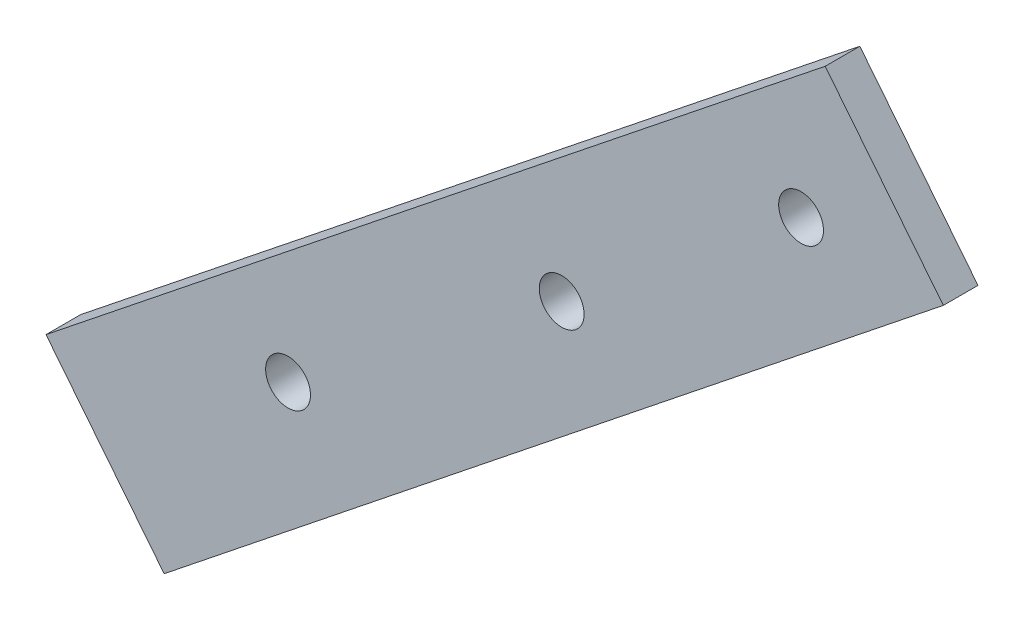
ISO-10303-21;
HEADER;
FILE_DESCRIPTION(('STEP AP214'),'2;1');
FILE_NAME('part.step','',(''),(''),'','','');
FILE_SCHEMA(('AUTOMOTIVE_DESIGN { 1 0 10303 214 1 1 1 1 }'));
ENDSEC;
DATA;
#1=APPLICATION_CONTEXT('core data for automotive mechanical design processes');
#2=APPLICATION_PROTOCOL_DEFINITION('international standard','automotive_design',2000,#1);
#3=PRODUCT_CONTEXT('',#1,'mechanical');
#4=PRODUCT('Part','Part','',(#3));
#5=PRODUCT_RELATED_PRODUCT_CATEGORY('part','',(#4));
#6=PRODUCT_DEFINITION_FORMATION('','',#4);
#7=PRODUCT_DEFINITION_CONTEXT('part definition',#1,'design');
#8=PRODUCT_DEFINITION('design','',#6,#7);
#9=PRODUCT_DEFINITION_SHAPE('','',#8);
#10=(LENGTH_UNIT() NAMED_UNIT(*) SI_UNIT(.MILLI.,.METRE.));
#11=(NAMED_UNIT(*) PLANE_ANGLE_UNIT() SI_UNIT($,.RADIAN.));
#12=(NAMED_UNIT(*) SI_UNIT($,.STERADIAN.) SOLID_ANGLE_UNIT());
#13=UNCERTAINTY_MEASURE_WITH_UNIT(LENGTH_MEASURE(1.E-05),#10,'distance_accuracy_value','');
#14=(GEOMETRIC_REPRESENTATION_CONTEXT(3) GLOBAL_UNCERTAINTY_ASSIGNED_CONTEXT((#13)) GLOBAL_UNIT_ASSIGNED_CONTEXT((#10,
#11,#12)) REPRESENTATION_CONTEXT('',''));
#15=CARTESIAN_POINT('',(0.,0.,0.));
#16=DIRECTION('',(0.,0.,1.));
#17=DIRECTION('',(1.,0.,0.));
#18=AXIS2_PLACEMENT_3D('',#15,#16,#17);
#19=CARTESIAN_POINT('',(0.,0.,10.));
#20=DIRECTION('',(0.,0.,-1.));
#21=DIRECTION('',(-1.,0.,0.));
#22=AXIS2_PLACEMENT_3D('',#19,#20,#21);
#23=PLANE('',#22);
#24=DIRECTION('',(0.781539754006802,0.623855442315756,0.));
#25=VECTOR('',#24,1.);
#26=CARTESIAN_POINT('',(224.825421521922,179.464399690875,10.));
#27=LINE('',#26,#25);
#28=CARTESIAN_POINT('',(0.,0.,10.));
#29=VERTEX_POINT('',#28);
#30=CARTESIAN_POINT('',(224.825421521922,179.464399690875,10.));
#31=VERTEX_POINT('',#30);
#32=EDGE_CURVE('E87',#29,#31,#27,.T.);
#33=ORIENTED_EDGE('',*,*,#32,.T.);
#34=DIRECTION('',(-0.623855442315756,0.781539754006802,0.));
#35=VECTOR('',#34,1.);
#36=CARTESIAN_POINT('',(190.731046947323,222.176392422936,10.));
#37=LINE('',#36,#35);
#38=CARTESIAN_POINT('',(190.731046947323,222.176392422936,10.));
#39=VERTEX_POINT('',#38);
#40=EDGE_CURVE('E82',#31,#39,#37,.T.);
#41=ORIENTED_EDGE('',*,*,#40,.T.);
#42=DIRECTION('',(-0.781539754006802,-0.623855442315756,0.));
#43=VECTOR('',#42,1.);
#44=CARTESIAN_POINT('',(-34.0943745745987,42.7119927320616,10.));
#45=LINE('',#44,#43);
#46=CARTESIAN_POINT('',(-34.0943745745987,42.7119927320616,10.));
#47=VERTEX_POINT('',#46);
#48=EDGE_CURVE('E85',#39,#47,#45,.T.);
#49=ORIENTED_EDGE('',*,*,#48,.T.);
#50=DIRECTION('',(0.623855442315756,-0.781539754006802,0.));
#51=VECTOR('',#50,1.);
#52=CARTESIAN_POINT('',(0.,0.,10.));
#53=LINE('',#52,#51);
#54=EDGE_CURVE('E52',#47,#29,#53,.T.);
#55=ORIENTED_EDGE('',*,*,#54,.T.);
#56=EDGE_LOOP('',(#33,#41,#49,#55));
#57=FACE_BOUND('',#56,.T.);
#58=CARTESIAN_POINT('',(35.7431737784992,65.7604217365133,10.));
#59=DIRECTION('',(0.,0.,1.));
#60=DIRECTION('',(1.,0.,0.));
#61=AXIS2_PLACEMENT_3D('',#58,#59,#60);
#62=CIRCLE('',#61,6.4699503332406);
#63=CARTESIAN_POINT('',(42.2131241117398,65.7604217365133,10.));
#64=VERTEX_POINT('',#63);
#65=EDGE_CURVE('E102',#64,#64,#62,.T.);
#66=ORIENTED_EDGE('',*,*,#65,.F.);
#67=EDGE_LOOP('',(#66));
#68=FACE_BOUND('',#67,.T.);
#69=CARTESIAN_POINT('',(114.698226452134,125.411384111032,10.));
#70=DIRECTION('',(0.,0.,1.));
#71=DIRECTION('',(1.,0.,0.));
#72=AXIS2_PLACEMENT_3D('',#69,#70,#71);
#73=CIRCLE('',#72,6.4699503332406);
#74=CARTESIAN_POINT('',(121.168176785375,125.411384111032,10.));
#75=VERTEX_POINT('',#74);
#76=EDGE_CURVE('E117',#75,#75,#73,.T.);
#77=ORIENTED_EDGE('',*,*,#76,.F.);
#78=EDGE_LOOP('',(#77));
#79=FACE_BOUND('',#78,.T.);
#80=CARTESIAN_POINT('',(183.769608582089,180.906879578004,10.));
#81=DIRECTION('',(0.,0.,1.));
#82=DIRECTION('',(1.,0.,0.));
#83=AXIS2_PLACEMENT_3D('',#80,#81,#82);
#84=CIRCLE('',#83,6.4699503332406);
#85=CARTESIAN_POINT('',(190.23955891533,180.906879578004,10.));
#86=VERTEX_POINT('',#85);
#87=EDGE_CURVE('E123',#86,#86,#84,.T.);
#88=ORIENTED_EDGE('',*,*,#87,.F.);
#89=EDGE_LOOP('',(#88));
#90=FACE_BOUND('',#89,.T.);
#91=ADVANCED_FACE('F35',(#57,#68,#79,#90),#23,.F.);
#92=CARTESIAN_POINT('',(0.,0.,0.));
#93=DIRECTION('',(0.,0.,-1.));
#94=DIRECTION('',(-1.,0.,0.));
#95=AXIS2_PLACEMENT_3D('',#92,#93,#94);
#96=PLANE('',#95);
#97=CARTESIAN_POINT('',(114.698226452134,125.411384111032,0.));
#98=DIRECTION('',(0.,0.,1.));
#99=DIRECTION('',(1.,0.,0.));
#100=AXIS2_PLACEMENT_3D('',#97,#98,#99);
#101=CIRCLE('',#100,6.4699503332406);
#102=CARTESIAN_POINT('',(121.168176785375,125.411384111032,0.));
#103=VERTEX_POINT('',#102);
#104=EDGE_CURVE('E120',#103,#103,#101,.T.);
#105=ORIENTED_EDGE('',*,*,#104,.T.);
#106=EDGE_LOOP('',(#105));
#107=FACE_BOUND('',#106,.T.);
#108=DIRECTION('',(0.781539754006802,0.623855442315756,0.));
#109=VECTOR('',#108,1.);
#110=CARTESIAN_POINT('',(224.825421521922,179.464399690875,0.));
#111=LINE('',#110,#109);
#112=CARTESIAN_POINT('',(0.,0.,0.));
#113=VERTEX_POINT('',#112);
#114=CARTESIAN_POINT('',(224.825421521922,179.464399690875,0.));
#115=VERTEX_POINT('',#114);
#116=EDGE_CURVE('E99',#113,#115,#111,.T.);
#117=ORIENTED_EDGE('',*,*,#116,.F.);
#118=DIRECTION('',(0.623855442315756,-0.781539754006802,0.));
#119=VECTOR('',#118,1.);
#120=CARTESIAN_POINT('',(0.,0.,0.));
#121=LINE('',#120,#119);
#122=CARTESIAN_POINT('',(-34.0943745745987,42.7119927320616,0.));
#123=VERTEX_POINT('',#122);
#124=EDGE_CURVE('E75',#123,#113,#121,.T.);
#125=ORIENTED_EDGE('',*,*,#124,.F.);
#126=DIRECTION('',(-0.781539754006802,-0.623855442315756,0.));
#127=VECTOR('',#126,1.);
#128=CARTESIAN_POINT('',(-34.0943745745987,42.7119927320616,0.));
#129=LINE('',#128,#127);
#130=CARTESIAN_POINT('',(190.731046947323,222.176392422936,0.));
#131=VERTEX_POINT('',#130);
#132=EDGE_CURVE('E69',#131,#123,#129,.T.);
#133=ORIENTED_EDGE('',*,*,#132,.F.);
#134=DIRECTION('',(-0.623855442315756,0.781539754006802,0.));
#135=VECTOR('',#134,1.);
#136=CARTESIAN_POINT('',(190.731046947323,222.176392422936,0.));
#137=LINE('',#136,#135);
#138=EDGE_CURVE('E91',#115,#131,#137,.T.);
#139=ORIENTED_EDGE('',*,*,#138,.F.);
#140=EDGE_LOOP('',(#117,#125,#133,#139));
#141=FACE_BOUND('',#140,.T.);
#142=CARTESIAN_POINT('',(35.7431737784992,65.7604217365133,0.));
#143=DIRECTION('',(0.,0.,1.));
#144=DIRECTION('',(1.,0.,0.));
#145=AXIS2_PLACEMENT_3D('',#142,#143,#144);
#146=CIRCLE('',#145,6.4699503332406);
#147=CARTESIAN_POINT('',(42.2131241117398,65.7604217365133,0.));
#148=VERTEX_POINT('',#147);
#149=EDGE_CURVE('E114',#148,#148,#146,.T.);
#150=ORIENTED_EDGE('',*,*,#149,.T.);
#151=EDGE_LOOP('',(#150));
#152=FACE_BOUND('',#151,.T.);
#153=CARTESIAN_POINT('',(183.769608582089,180.906879578004,0.));
#154=DIRECTION('',(0.,0.,1.));
#155=DIRECTION('',(1.,0.,0.));
#156=AXIS2_PLACEMENT_3D('',#153,#154,#155);
#157=CIRCLE('',#156,6.4699503332406);
#158=CARTESIAN_POINT('',(190.23955891533,180.906879578004,0.));
#159=VERTEX_POINT('',#158);
#160=EDGE_CURVE('E126',#159,#159,#157,.T.);
#161=ORIENTED_EDGE('',*,*,#160,.T.);
#162=EDGE_LOOP('',(#161));
#163=FACE_BOUND('',#162,.T.);
#164=ADVANCED_FACE('F110',(#107,#141,#152,#163),#96,.T.);
#165=CARTESIAN_POINT('',(224.825421521922,179.464399690875,10.));
#166=DIRECTION('',(-0.623855442315756,0.781539754006802,0.));
#167=DIRECTION('',(-0.781539754006802,-0.623855442315756,0.));
#168=AXIS2_PLACEMENT_3D('',#165,#166,#167);
#169=PLANE('',#168);
#170=ORIENTED_EDGE('',*,*,#116,.T.);
#171=DIRECTION('',(0.,0.,-1.));
#172=VECTOR('',#171,1.);
#173=CARTESIAN_POINT('',(224.825421521922,179.464399690875,10.));
#174=LINE('',#173,#172);
#175=EDGE_CURVE('E11',#31,#115,#174,.T.);
#176=ORIENTED_EDGE('',*,*,#175,.F.);
#177=ORIENTED_EDGE('',*,*,#32,.F.);
#178=DIRECTION('',(0.,0.,-1.));
#179=VECTOR('',#178,1.);
#180=CARTESIAN_POINT('',(0.,0.,10.));
#181=LINE('',#180,#179);
#182=EDGE_CURVE('E95',#29,#113,#181,.T.);
#183=ORIENTED_EDGE('',*,*,#182,.T.);
#184=EDGE_LOOP('',(#170,#176,#177,#183));
#185=FACE_BOUND('',#184,.T.);
#186=ADVANCED_FACE('F37',(#185),#169,.F.);
#187=CARTESIAN_POINT('',(190.731046947323,222.176392422936,10.));
#188=DIRECTION('',(-0.781539754006802,-0.623855442315756,0.));
#189=DIRECTION('',(0.623855442315756,-0.781539754006802,0.));
#190=AXIS2_PLACEMENT_3D('',#187,#188,#189);
#191=PLANE('',#190);
#192=ORIENTED_EDGE('',*,*,#138,.T.);
#193=DIRECTION('',(0.,0.,-1.));
#194=VECTOR('',#193,1.);
#195=CARTESIAN_POINT('',(190.731046947323,222.176392422936,10.));
#196=LINE('',#195,#194);
#197=EDGE_CURVE('E44',#39,#131,#196,.T.);
#198=ORIENTED_EDGE('',*,*,#197,.F.);
#199=ORIENTED_EDGE('',*,*,#40,.F.);
#200=ORIENTED_EDGE('',*,*,#175,.T.);
#201=EDGE_LOOP('',(#192,#198,#199,#200));
#202=FACE_BOUND('',#201,.T.);
#203=ADVANCED_FACE('F90',(#202),#191,.F.);
#204=CARTESIAN_POINT('',(-34.0943745745987,42.7119927320616,10.));
#205=DIRECTION('',(0.623855442315756,-0.781539754006802,0.));
#206=DIRECTION('',(0.781539754006802,0.623855442315756,0.));
#207=AXIS2_PLACEMENT_3D('',#204,#205,#206);
#208=PLANE('',#207);
#209=ORIENTED_EDGE('',*,*,#132,.T.);
#210=DIRECTION('',(0.,0.,-1.));
#211=VECTOR('',#210,1.);
#212=CARTESIAN_POINT('',(-34.0943745745987,42.7119927320616,10.));
#213=LINE('',#212,#211);
#214=EDGE_CURVE('E92',#47,#123,#213,.T.);
#215=ORIENTED_EDGE('',*,*,#214,.F.);
#216=ORIENTED_EDGE('',*,*,#48,.F.);
#217=ORIENTED_EDGE('',*,*,#197,.T.);
#218=EDGE_LOOP('',(#209,#215,#216,#217));
#219=FACE_BOUND('',#218,.T.);
#220=ADVANCED_FACE('F93',(#219),#208,.F.);
#221=CARTESIAN_POINT('',(0.,0.,10.));
#222=DIRECTION('',(0.781539754006802,0.623855442315756,0.));
#223=DIRECTION('',(-0.623855442315756,0.781539754006802,0.));
#224=AXIS2_PLACEMENT_3D('',#221,#222,#223);
#225=PLANE('',#224);
#226=ORIENTED_EDGE('',*,*,#124,.T.);
#227=ORIENTED_EDGE('',*,*,#182,.F.);
#228=ORIENTED_EDGE('',*,*,#54,.F.);
#229=ORIENTED_EDGE('',*,*,#214,.T.);
#230=EDGE_LOOP('',(#226,#227,#228,#229));
#231=FACE_BOUND('',#230,.T.);
#232=ADVANCED_FACE('F107',(#231),#225,.F.);
#233=CARTESIAN_POINT('',(35.7431737784992,65.7604217365133,10.));
#234=DIRECTION('',(0.,0.,-1.));
#235=DIRECTION('',(-1.,0.,0.));
#236=AXIS2_PLACEMENT_3D('',#233,#234,#235);
#237=CYLINDRICAL_SURFACE('',#236,6.4699503332406);
#238=ORIENTED_EDGE('',*,*,#65,.T.);
#239=EDGE_LOOP('',(#238));
#240=FACE_BOUND('',#239,.T.);
#241=ORIENTED_EDGE('',*,*,#149,.F.);
#242=EDGE_LOOP('',(#241));
#243=FACE_BOUND('',#242,.T.);
#244=ADVANCED_FACE('F143',(#240,#243),#237,.F.);
#245=CARTESIAN_POINT('',(114.698226452134,125.411384111032,10.));
#246=DIRECTION('',(0.,0.,-1.));
#247=DIRECTION('',(-1.,0.,0.));
#248=AXIS2_PLACEMENT_3D('',#245,#246,#247);
#249=CYLINDRICAL_SURFACE('',#248,6.4699503332406);
#250=ORIENTED_EDGE('',*,*,#76,.T.);
#251=EDGE_LOOP('',(#250));
#252=FACE_BOUND('',#251,.T.);
#253=ORIENTED_EDGE('',*,*,#104,.F.);
#254=EDGE_LOOP('',(#253));
#255=FACE_BOUND('',#254,.T.);
#256=ADVANCED_FACE('F189',(#252,#255),#249,.F.);
#257=CARTESIAN_POINT('',(183.769608582089,180.906879578004,10.));
#258=DIRECTION('',(0.,0.,-1.));
#259=DIRECTION('',(-1.,0.,0.));
#260=AXIS2_PLACEMENT_3D('',#257,#258,#259);
#261=CYLINDRICAL_SURFACE('',#260,6.4699503332406);
#262=ORIENTED_EDGE('',*,*,#87,.T.);
#263=EDGE_LOOP('',(#262));
#264=FACE_BOUND('',#263,.T.);
#265=ORIENTED_EDGE('',*,*,#160,.F.);
#266=EDGE_LOOP('',(#265));
#267=FACE_BOUND('',#266,.T.);
#268=ADVANCED_FACE('F132',(#264,#267),#261,.F.);
#269=CLOSED_SHELL('',(#91,#164,#186,#203,#220,#232,#244,#256,#268));
#270=MANIFOLD_SOLID_BREP('B2',#269);
#271=ADVANCED_BREP_SHAPE_REPRESENTATION('',(#18,#270),#14);
#272=SHAPE_DEFINITION_REPRESENTATION(#9,#271);
ENDSEC;
END-ISO-10303-21;
